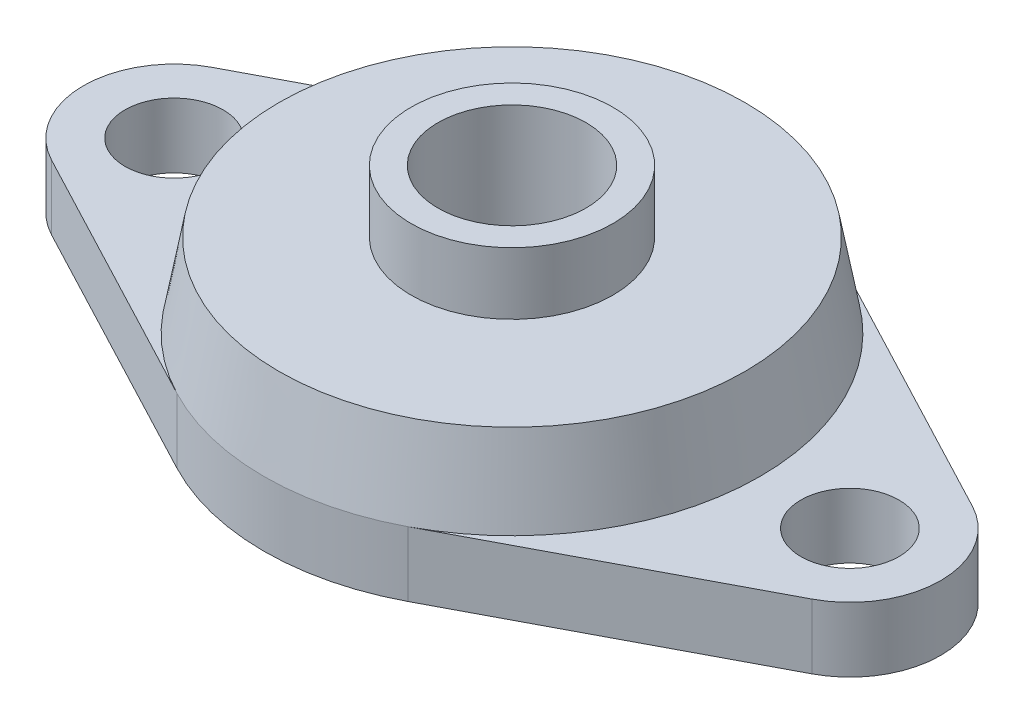
ISO-10303-21;
HEADER;
FILE_DESCRIPTION(('STEP AP214'),'2;1');
FILE_NAME('part.step','',(''),(''),'','','');
FILE_SCHEMA(('AUTOMOTIVE_DESIGN { 1 0 10303 214 1 1 1 1 }'));
ENDSEC;
DATA;
#1=APPLICATION_CONTEXT('core data for automotive mechanical design processes');
#2=APPLICATION_PROTOCOL_DEFINITION('international standard','automotive_design',2000,#1);
#3=PRODUCT_CONTEXT('',#1,'mechanical');
#4=PRODUCT('Part','Part','',(#3));
#5=PRODUCT_RELATED_PRODUCT_CATEGORY('part','',(#4));
#6=PRODUCT_DEFINITION_FORMATION('','',#4);
#7=PRODUCT_DEFINITION_CONTEXT('part definition',#1,'design');
#8=PRODUCT_DEFINITION('design','',#6,#7);
#9=PRODUCT_DEFINITION_SHAPE('','',#8);
#10=(LENGTH_UNIT() NAMED_UNIT(*) SI_UNIT(.MILLI.,.METRE.));
#11=(NAMED_UNIT(*) PLANE_ANGLE_UNIT() SI_UNIT($,.RADIAN.));
#12=(NAMED_UNIT(*) SI_UNIT($,.STERADIAN.) SOLID_ANGLE_UNIT());
#13=UNCERTAINTY_MEASURE_WITH_UNIT(LENGTH_MEASURE(1.E-05),#10,'distance_accuracy_value','');
#14=(GEOMETRIC_REPRESENTATION_CONTEXT(3) GLOBAL_UNCERTAINTY_ASSIGNED_CONTEXT((#13)) GLOBAL_UNIT_ASSIGNED_CONTEXT((#10,
#11,#12)) REPRESENTATION_CONTEXT('',''));
#15=CARTESIAN_POINT('',(0.,0.,0.));
#16=DIRECTION('',(0.,0.,1.));
#17=DIRECTION('',(1.,0.,0.));
#18=AXIS2_PLACEMENT_3D('',#15,#16,#17);
#19=CARTESIAN_POINT('',(-18.25,3.5,0.));
#20=DIRECTION('',(0.,1.,0.));
#21=DIRECTION('',(0.,0.,1.));
#22=AXIS2_PLACEMENT_3D('',#19,#20,#21);
#23=PLANE('',#22);
#24=CARTESIAN_POINT('',(18.25,3.5,0.));
#25=DIRECTION('',(0.,1.,0.));
#26=DIRECTION('',(0.,0.,1.));
#27=AXIS2_PLACEMENT_3D('',#24,#25,#26);
#28=CIRCLE('',#27,2.65);
#29=CARTESIAN_POINT('',(18.25,3.5,2.65));
#30=VERTEX_POINT('',#29);
#31=EDGE_CURVE('E227',#30,#30,#28,.T.);
#32=ORIENTED_EDGE('',*,*,#31,.F.);
#33=EDGE_LOOP('',(#32));
#34=FACE_BOUND('',#33,.T.);
#35=CARTESIAN_POINT('',(0.,3.50000000001014,0.));
#36=DIRECTION('',(0.,-1.,0.));
#37=DIRECTION('',(1.,0.,0.));
#38=AXIS2_PLACEMENT_3D('',#35,#36,#37);
#39=CIRCLE('',#38,13.4);
#40=CARTESIAN_POINT('',(6.24109589041096,3.50000000001013,-11.8578548686807));
#41=VERTEX_POINT('',#40);
#42=CARTESIAN_POINT('',(6.24109589041096,3.50000000001013,11.8578548686807));
#43=VERTEX_POINT('',#42);
#44=EDGE_CURVE('E125',#41,#43,#39,.T.);
#45=ORIENTED_EDGE('',*,*,#44,.T.);
#46=DIRECTION('',(0.884914542438861,0.,-0.465753424657534));
#47=VECTOR('',#46,1.);
#48=CARTESIAN_POINT('',(6.24109589041096,3.5,11.8578548686807));
#49=LINE('',#48,#47);
#50=CARTESIAN_POINT('',(20.5321917808219,3.5,4.33608125795042));
#51=VERTEX_POINT('',#50);
#52=EDGE_CURVE('E141',#43,#51,#49,.T.);
#53=ORIENTED_EDGE('',*,*,#52,.T.);
#54=CARTESIAN_POINT('',(18.25,3.5,0.));
#55=DIRECTION('',(0.,-1.,0.));
#56=DIRECTION('',(0.,0.,1.));
#57=AXIS2_PLACEMENT_3D('',#54,#55,#56);
#58=CIRCLE('',#57,4.9);
#59=CARTESIAN_POINT('',(20.5321917808219,3.5,-4.33608125795042));
#60=VERTEX_POINT('',#59);
#61=EDGE_CURVE('E106',#60,#51,#58,.T.);
#62=ORIENTED_EDGE('',*,*,#61,.F.);
#63=DIRECTION('',(0.884914542438861,0.,0.465753424657534));
#64=VECTOR('',#63,1.);
#65=CARTESIAN_POINT('',(6.24109589041096,3.5,-11.8578548686807));
#66=LINE('',#65,#64);
#67=EDGE_CURVE('E70',#41,#60,#66,.T.);
#68=ORIENTED_EDGE('',*,*,#67,.F.);
#69=EDGE_LOOP('',(#45,#53,#62,#68));
#70=FACE_BOUND('',#69,.T.);
#71=ADVANCED_FACE('F34',(#34,#70),#23,.T.);
#72=CARTESIAN_POINT('',(-18.25,3.5,0.));
#73=DIRECTION('',(0.,-1.,0.));
#74=DIRECTION('',(0.,0.,-1.));
#75=AXIS2_PLACEMENT_3D('',#72,#73,#74);
#76=CYLINDRICAL_SURFACE('',#75,4.9);
#77=CARTESIAN_POINT('',(-18.25,0.,0.));
#78=DIRECTION('',(0.,1.,0.));
#79=DIRECTION('',(0.,0.,1.));
#80=AXIS2_PLACEMENT_3D('',#77,#78,#79);
#81=CIRCLE('',#80,4.9);
#82=CARTESIAN_POINT('',(-20.5321917808219,0.,-4.33608125795042));
#83=VERTEX_POINT('',#82);
#84=CARTESIAN_POINT('',(-20.5321917808219,0.,4.33608125795042));
#85=VERTEX_POINT('',#84);
#86=EDGE_CURVE('E173',#83,#85,#81,.T.);
#87=ORIENTED_EDGE('',*,*,#86,.T.);
#88=DIRECTION('',(0.,-1.,0.));
#89=VECTOR('',#88,1.);
#90=CARTESIAN_POINT('',(-20.5321917808219,3.5,4.33608125795042));
#91=LINE('',#90,#89);
#92=CARTESIAN_POINT('',(-20.5321917808219,3.5,4.33608125795042));
#93=VERTEX_POINT('',#92);
#94=EDGE_CURVE('E157',#93,#85,#91,.T.);
#95=ORIENTED_EDGE('',*,*,#94,.F.);
#96=CARTESIAN_POINT('',(-18.25,3.5,0.));
#97=DIRECTION('',(0.,1.,0.));
#98=DIRECTION('',(0.,0.,1.));
#99=AXIS2_PLACEMENT_3D('',#96,#97,#98);
#100=CIRCLE('',#99,4.9);
#101=CARTESIAN_POINT('',(-20.5321917808219,3.5,-4.33608125795042));
#102=VERTEX_POINT('',#101);
#103=EDGE_CURVE('E85',#102,#93,#100,.T.);
#104=ORIENTED_EDGE('',*,*,#103,.F.);
#105=DIRECTION('',(0.,-1.,0.));
#106=VECTOR('',#105,1.);
#107=CARTESIAN_POINT('',(-20.5321917808219,3.5,-4.33608125795042));
#108=LINE('',#107,#106);
#109=EDGE_CURVE('E43',#102,#83,#108,.T.);
#110=ORIENTED_EDGE('',*,*,#109,.T.);
#111=EDGE_LOOP('',(#87,#95,#104,#110));
#112=FACE_BOUND('',#111,.T.);
#113=ADVANCED_FACE('F36',(#112),#76,.T.);
#114=CARTESIAN_POINT('',(0.,3.5,0.));
#115=DIRECTION('',(0.,-1.,0.));
#116=DIRECTION('',(0.,0.,-1.));
#117=AXIS2_PLACEMENT_3D('',#114,#115,#116);
#118=CYLINDRICAL_SURFACE('',#117,13.4);
#119=CARTESIAN_POINT('',(0.,0.,0.));
#120=DIRECTION('',(0.,1.,0.));
#121=DIRECTION('',(0.,0.,1.));
#122=AXIS2_PLACEMENT_3D('',#119,#120,#121);
#123=CIRCLE('',#122,13.4);
#124=CARTESIAN_POINT('',(6.24109589041096,0.,-11.8578548686807));
#125=VERTEX_POINT('',#124);
#126=CARTESIAN_POINT('',(-6.24109589041096,0.,-11.8578548686807));
#127=VERTEX_POINT('',#126);
#128=EDGE_CURVE('E63',#125,#127,#123,.T.);
#129=ORIENTED_EDGE('',*,*,#128,.T.);
#130=DIRECTION('',(0.,-1.,0.));
#131=VECTOR('',#130,1.);
#132=CARTESIAN_POINT('',(-6.24109589041096,3.5,-11.8578548686807));
#133=LINE('',#132,#131);
#134=CARTESIAN_POINT('',(-6.24109589041096,3.50000000001014,-11.8578548686807));
#135=VERTEX_POINT('',#134);
#136=EDGE_CURVE('E11',#135,#127,#133,.T.);
#137=ORIENTED_EDGE('',*,*,#136,.F.);
#138=CARTESIAN_POINT('',(0.,3.5,0.));
#139=DIRECTION('',(0.,1.,0.));
#140=DIRECTION('',(0.,0.,1.));
#141=AXIS2_PLACEMENT_3D('',#138,#139,#140);
#142=CIRCLE('',#141,13.4);
#143=EDGE_CURVE('E128',#41,#135,#142,.T.);
#144=ORIENTED_EDGE('',*,*,#143,.F.);
#145=DIRECTION('',(0.,-1.,0.));
#146=VECTOR('',#145,1.);
#147=CARTESIAN_POINT('',(6.24109589041096,3.5,-11.8578548686807));
#148=LINE('',#147,#146);
#149=EDGE_CURVE('E171',#41,#125,#148,.T.);
#150=ORIENTED_EDGE('',*,*,#149,.T.);
#151=EDGE_LOOP('',(#129,#137,#144,#150));
#152=FACE_BOUND('',#151,.T.);
#153=ADVANCED_FACE('F189',(#152),#118,.T.);
#154=CARTESIAN_POINT('',(-6.24109589041096,3.5,-11.8578548686807));
#155=DIRECTION('',(0.465753424657534,0.,0.884914542438861));
#156=DIRECTION('',(0.884914542438861,0.,-0.465753424657534));
#157=AXIS2_PLACEMENT_3D('',#154,#155,#156);
#158=PLANE('',#157);
#159=DIRECTION('',(-0.884914542438861,0.,0.465753424657534));
#160=VECTOR('',#159,1.);
#161=CARTESIAN_POINT('',(-6.24109589041096,0.,-11.8578548686807));
#162=LINE('',#161,#160);
#163=EDGE_CURVE('E175',#127,#83,#162,.T.);
#164=ORIENTED_EDGE('',*,*,#163,.T.);
#165=ORIENTED_EDGE('',*,*,#109,.F.);
#166=DIRECTION('',(-0.884914542438861,0.,0.465753424657534));
#167=VECTOR('',#166,1.);
#168=CARTESIAN_POINT('',(-6.24109589041096,3.5,-11.8578548686807));
#169=LINE('',#168,#167);
#170=EDGE_CURVE('E50',#135,#102,#169,.T.);
#171=ORIENTED_EDGE('',*,*,#170,.F.);
#172=ORIENTED_EDGE('',*,*,#136,.T.);
#173=EDGE_LOOP('',(#164,#165,#171,#172));
#174=FACE_BOUND('',#173,.T.);
#175=ADVANCED_FACE('F190',(#174),#158,.F.);
#176=CARTESIAN_POINT('',(-18.25,3.5,0.));
#177=DIRECTION('',(0.,1.,0.));
#178=DIRECTION('',(0.,0.,1.));
#179=AXIS2_PLACEMENT_3D('',#176,#177,#178);
#180=CIRCLE('',#179,2.65);
#181=CARTESIAN_POINT('',(-18.25,3.5,2.65));
#182=VERTEX_POINT('',#181);
#183=EDGE_CURVE('E363',#182,#182,#180,.T.);
#184=ORIENTED_EDGE('',*,*,#183,.F.);
#185=EDGE_LOOP('',(#184));
#186=FACE_BOUND('',#185,.T.);
#187=CARTESIAN_POINT('',(-6.24109589041096,3.5,11.8578548686807));
#188=VERTEX_POINT('',#187);
#189=EDGE_CURVE('E133',#188,#135,#39,.T.);
#190=ORIENTED_EDGE('',*,*,#189,.T.);
#191=ORIENTED_EDGE('',*,*,#170,.T.);
#192=ORIENTED_EDGE('',*,*,#103,.T.);
#193=DIRECTION('',(-0.884914542438861,0.,-0.465753424657534));
#194=VECTOR('',#193,1.);
#195=CARTESIAN_POINT('',(-6.24109589041096,3.5,11.8578548686807));
#196=LINE('',#195,#194);
#197=EDGE_CURVE('E136',#188,#93,#196,.T.);
#198=ORIENTED_EDGE('',*,*,#197,.F.);
#199=EDGE_LOOP('',(#190,#191,#192,#198));
#200=FACE_BOUND('',#199,.T.);
#201=ADVANCED_FACE('F187',(#186,#200),#23,.T.);
#202=CARTESIAN_POINT('',(-18.25,0.,0.));
#203=DIRECTION('',(0.,1.,0.));
#204=DIRECTION('',(0.,0.,1.));
#205=AXIS2_PLACEMENT_3D('',#202,#203,#204);
#206=PLANE('',#205);
#207=CARTESIAN_POINT('',(-18.25,0.,0.));
#208=DIRECTION('',(0.,-1.,0.));
#209=DIRECTION('',(0.,0.,-1.));
#210=AXIS2_PLACEMENT_3D('',#207,#208,#209);
#211=CIRCLE('',#210,2.65);
#212=CARTESIAN_POINT('',(-18.25,0.,-2.65));
#213=VERTEX_POINT('',#212);
#214=EDGE_CURVE('E218',#213,#213,#211,.T.);
#215=ORIENTED_EDGE('',*,*,#214,.F.);
#216=EDGE_LOOP('',(#215));
#217=FACE_BOUND('',#216,.T.);
#218=CARTESIAN_POINT('',(18.25,0.,0.));
#219=DIRECTION('',(0.,-1.,0.));
#220=DIRECTION('',(0.,0.,-1.));
#221=AXIS2_PLACEMENT_3D('',#218,#219,#220);
#222=CIRCLE('',#221,2.65);
#223=CARTESIAN_POINT('',(18.25,0.,-2.65));
#224=VERTEX_POINT('',#223);
#225=EDGE_CURVE('E222',#224,#224,#222,.T.);
#226=ORIENTED_EDGE('',*,*,#225,.F.);
#227=EDGE_LOOP('',(#226));
#228=FACE_BOUND('',#227,.T.);
#229=CARTESIAN_POINT('',(0.,0.,0.));
#230=DIRECTION('',(0.,-1.,0.));
#231=DIRECTION('',(0.,0.,-1.));
#232=AXIS2_PLACEMENT_3D('',#229,#230,#231);
#233=CIRCLE('',#232,4.);
#234=CARTESIAN_POINT('',(0.,0.,-4.));
#235=VERTEX_POINT('',#234);
#236=EDGE_CURVE('E225',#235,#235,#233,.T.);
#237=ORIENTED_EDGE('',*,*,#236,.F.);
#238=EDGE_LOOP('',(#237));
#239=FACE_BOUND('',#238,.T.);
#240=ORIENTED_EDGE('',*,*,#163,.F.);
#241=ORIENTED_EDGE('',*,*,#128,.F.);
#242=DIRECTION('',(0.884914542438861,0.,0.465753424657534));
#243=VECTOR('',#242,1.);
#244=CARTESIAN_POINT('',(6.24109589041096,0.,-11.8578548686807));
#245=LINE('',#244,#243);
#246=CARTESIAN_POINT('',(20.5321917808219,0.,-4.33608125795042));
#247=VERTEX_POINT('',#246);
#248=EDGE_CURVE('E165',#125,#247,#245,.T.);
#249=ORIENTED_EDGE('',*,*,#248,.T.);
#250=CARTESIAN_POINT('',(18.25,0.,0.));
#251=DIRECTION('',(0.,-1.,0.));
#252=DIRECTION('',(0.,0.,1.));
#253=AXIS2_PLACEMENT_3D('',#250,#251,#252);
#254=CIRCLE('',#253,4.9);
#255=CARTESIAN_POINT('',(20.5321917808219,0.,4.33608125795042));
#256=VERTEX_POINT('',#255);
#257=EDGE_CURVE('E163',#247,#256,#254,.T.);
#258=ORIENTED_EDGE('',*,*,#257,.T.);
#259=DIRECTION('',(0.884914542438861,0.,-0.465753424657534));
#260=VECTOR('',#259,1.);
#261=CARTESIAN_POINT('',(6.24109589041096,0.,11.8578548686807));
#262=LINE('',#261,#260);
#263=CARTESIAN_POINT('',(6.24109589041096,0.,11.8578548686807));
#264=VERTEX_POINT('',#263);
#265=EDGE_CURVE('E117',#264,#256,#262,.T.);
#266=ORIENTED_EDGE('',*,*,#265,.F.);
#267=CARTESIAN_POINT('',(0.,0.,0.));
#268=DIRECTION('',(0.,-1.,0.));
#269=DIRECTION('',(0.,0.,-1.));
#270=AXIS2_PLACEMENT_3D('',#267,#268,#269);
#271=CIRCLE('',#270,13.4);
#272=CARTESIAN_POINT('',(-6.24109589041096,0.,11.8578548686807));
#273=VERTEX_POINT('',#272);
#274=EDGE_CURVE('E151',#264,#273,#271,.T.);
#275=ORIENTED_EDGE('',*,*,#274,.T.);
#276=DIRECTION('',(-0.884914542438861,0.,-0.465753424657534));
#277=VECTOR('',#276,1.);
#278=CARTESIAN_POINT('',(-6.24109589041096,0.,11.8578548686807));
#279=LINE('',#278,#277);
#280=EDGE_CURVE('E97',#273,#85,#279,.T.);
#281=ORIENTED_EDGE('',*,*,#280,.T.);
#282=ORIENTED_EDGE('',*,*,#86,.F.);
#283=EDGE_LOOP('',(#240,#241,#249,#258,#266,#275,#281,#282));
#284=FACE_BOUND('',#283,.T.);
#285=ADVANCED_FACE('F185',(#217,#228,#239,#284),#206,.F.);
#286=CARTESIAN_POINT('',(18.25,3.5,0.));
#287=DIRECTION('',(0.,-1.,0.));
#288=DIRECTION('',(0.,0.,-1.));
#289=AXIS2_PLACEMENT_3D('',#286,#287,#288);
#290=CYLINDRICAL_SURFACE('',#289,4.9);
#291=ORIENTED_EDGE('',*,*,#257,.F.);
#292=DIRECTION('',(0.,-1.,0.));
#293=VECTOR('',#292,1.);
#294=CARTESIAN_POINT('',(20.5321917808219,3.5,-4.33608125795042));
#295=LINE('',#294,#293);
#296=EDGE_CURVE('E167',#60,#247,#295,.T.);
#297=ORIENTED_EDGE('',*,*,#296,.F.);
#298=ORIENTED_EDGE('',*,*,#61,.T.);
#299=DIRECTION('',(0.,-1.,0.));
#300=VECTOR('',#299,1.);
#301=CARTESIAN_POINT('',(20.5321917808219,3.5,4.33608125795042));
#302=LINE('',#301,#300);
#303=EDGE_CURVE('E148',#51,#256,#302,.T.);
#304=ORIENTED_EDGE('',*,*,#303,.T.);
#305=EDGE_LOOP('',(#291,#297,#298,#304));
#306=FACE_BOUND('',#305,.T.);
#307=ADVANCED_FACE('F207',(#306),#290,.T.);
#308=CARTESIAN_POINT('',(6.24109589041096,3.5,-11.8578548686807));
#309=DIRECTION('',(-0.465753424657534,0.,0.884914542438861));
#310=DIRECTION('',(-0.884914542438861,0.,-0.465753424657534));
#311=AXIS2_PLACEMENT_3D('',#308,#309,#310);
#312=PLANE('',#311);
#313=ORIENTED_EDGE('',*,*,#248,.F.);
#314=ORIENTED_EDGE('',*,*,#149,.F.);
#315=ORIENTED_EDGE('',*,*,#67,.T.);
#316=ORIENTED_EDGE('',*,*,#296,.T.);
#317=EDGE_LOOP('',(#313,#314,#315,#316));
#318=FACE_BOUND('',#317,.T.);
#319=ADVANCED_FACE('F214',(#318),#312,.F.);
#320=CARTESIAN_POINT('',(0.,3.5,0.));
#321=DIRECTION('',(0.,-1.,0.));
#322=DIRECTION('',(0.,0.,1.));
#323=AXIS2_PLACEMENT_3D('',#320,#321,#322);
#324=CYLINDRICAL_SURFACE('',#323,13.4);
#325=ORIENTED_EDGE('',*,*,#274,.F.);
#326=DIRECTION('',(0.,-1.,0.));
#327=VECTOR('',#326,1.);
#328=CARTESIAN_POINT('',(6.24109589041096,3.5,11.8578548686807));
#329=LINE('',#328,#327);
#330=EDGE_CURVE('E146',#43,#264,#329,.T.);
#331=ORIENTED_EDGE('',*,*,#330,.F.);
#332=CARTESIAN_POINT('',(0.,3.5,0.));
#333=DIRECTION('',(0.,-1.,0.));
#334=DIRECTION('',(0.,0.,-1.));
#335=AXIS2_PLACEMENT_3D('',#332,#333,#334);
#336=CIRCLE('',#335,13.4);
#337=EDGE_CURVE('E131',#43,#188,#336,.T.);
#338=ORIENTED_EDGE('',*,*,#337,.T.);
#339=DIRECTION('',(0.,-1.,0.));
#340=VECTOR('',#339,1.);
#341=CARTESIAN_POINT('',(-6.24109589041096,3.5,11.8578548686807));
#342=LINE('',#341,#340);
#343=EDGE_CURVE('E161',#188,#273,#342,.T.);
#344=ORIENTED_EDGE('',*,*,#343,.T.);
#345=EDGE_LOOP('',(#325,#331,#338,#344));
#346=FACE_BOUND('',#345,.T.);
#347=ADVANCED_FACE('F150',(#346),#324,.T.);
#348=CARTESIAN_POINT('',(-6.24109589041096,3.5,11.8578548686807));
#349=DIRECTION('',(0.465753424657534,0.,-0.884914542438861));
#350=DIRECTION('',(0.884914542438861,0.,0.465753424657534));
#351=AXIS2_PLACEMENT_3D('',#348,#349,#350);
#352=PLANE('',#351);
#353=ORIENTED_EDGE('',*,*,#280,.F.);
#354=ORIENTED_EDGE('',*,*,#343,.F.);
#355=ORIENTED_EDGE('',*,*,#197,.T.);
#356=ORIENTED_EDGE('',*,*,#94,.T.);
#357=EDGE_LOOP('',(#353,#354,#355,#356));
#358=FACE_BOUND('',#357,.T.);
#359=ADVANCED_FACE('F186',(#358),#352,.F.);
#360=CARTESIAN_POINT('',(6.24109589041096,3.5,11.8578548686807));
#361=DIRECTION('',(-0.465753424657534,0.,-0.884914542438861));
#362=DIRECTION('',(-0.884914542438861,0.,0.465753424657534));
#363=AXIS2_PLACEMENT_3D('',#360,#361,#362);
#364=PLANE('',#363);
#365=ORIENTED_EDGE('',*,*,#265,.T.);
#366=ORIENTED_EDGE('',*,*,#303,.F.);
#367=ORIENTED_EDGE('',*,*,#52,.F.);
#368=ORIENTED_EDGE('',*,*,#330,.T.);
#369=EDGE_LOOP('',(#365,#366,#367,#368));
#370=FACE_BOUND('',#369,.T.);
#371=ADVANCED_FACE('F145',(#370),#364,.F.);
#372=CARTESIAN_POINT('',(0.,11.3499999999931,0.));
#373=DIRECTION('',(0.,1.,0.));
#374=DIRECTION('',(-1.,0.,0.));
#375=AXIS2_PLACEMENT_3D('',#372,#373,#374);
#376=PLANE('',#375);
#377=CARTESIAN_POINT('',(0.,11.3499999999931,0.));
#378=DIRECTION('',(0.,-1.,0.));
#379=DIRECTION('',(0.,0.,-1.));
#380=AXIS2_PLACEMENT_3D('',#377,#378,#379);
#381=CIRCLE('',#380,4.);
#382=CARTESIAN_POINT('',(0.,11.3499999999931,-4.));
#383=VERTEX_POINT('',#382);
#384=EDGE_CURVE('E142',#383,#383,#381,.T.);
#385=ORIENTED_EDGE('',*,*,#384,.T.);
#386=EDGE_LOOP('',(#385));
#387=FACE_BOUND('',#386,.T.);
#388=CARTESIAN_POINT('',(0.,11.3499999999931,0.));
#389=DIRECTION('',(0.,-1.,0.));
#390=DIRECTION('',(1.,0.,0.));
#391=AXIS2_PLACEMENT_3D('',#388,#389,#390);
#392=CIRCLE('',#391,5.44999984985275);
#393=CARTESIAN_POINT('',(5.44999984985276,11.3499999999931,0.));
#394=VERTEX_POINT('',#393);
#395=EDGE_CURVE('E239',#394,#394,#392,.T.);
#396=ORIENTED_EDGE('',*,*,#395,.F.);
#397=EDGE_LOOP('',(#396));
#398=FACE_BOUND('',#397,.T.);
#399=ADVANCED_FACE('F246',(#387,#398),#376,.T.);
#400=CARTESIAN_POINT('',(0.,0.,0.));
#401=DIRECTION('',(0.,-1.,0.));
#402=DIRECTION('',(1.,0.,0.));
#403=AXIS2_PLACEMENT_3D('',#400,#401,#402);
#404=CYLINDRICAL_SURFACE('',#403,5.44999984985275);
#405=ORIENTED_EDGE('',*,*,#395,.T.);
#406=EDGE_LOOP('',(#405));
#407=FACE_BOUND('',#406,.T.);
#408=CARTESIAN_POINT('',(0.,7.99999976023933,0.));
#409=DIRECTION('',(0.,-1.,0.));
#410=DIRECTION('',(1.,0.,0.));
#411=AXIS2_PLACEMENT_3D('',#408,#409,#410);
#412=CIRCLE('',#411,5.44999984985275);
#413=CARTESIAN_POINT('',(5.44999984985276,7.99999976023932,0.));
#414=VERTEX_POINT('',#413);
#415=EDGE_CURVE('E236',#414,#414,#412,.T.);
#416=ORIENTED_EDGE('',*,*,#415,.F.);
#417=EDGE_LOOP('',(#416));
#418=FACE_BOUND('',#417,.T.);
#419=ADVANCED_FACE('F243',(#407,#418),#404,.T.);
#420=CARTESIAN_POINT('',(5.44999984985276,7.99999976023933,0.));
#421=DIRECTION('',(0.,1.,0.));
#422=DIRECTION('',(-1.,0.,0.));
#423=AXIS2_PLACEMENT_3D('',#420,#421,#422);
#424=PLANE('',#423);
#425=ORIENTED_EDGE('',*,*,#415,.T.);
#426=EDGE_LOOP('',(#425));
#427=FACE_BOUND('',#426,.T.);
#428=CARTESIAN_POINT('',(0.,7.99999976023933,0.));
#429=DIRECTION('',(0.,-1.,0.));
#430=DIRECTION('',(1.,0.,0.));
#431=AXIS2_PLACEMENT_3D('',#428,#429,#430);
#432=CIRCLE('',#431,12.5825393847694);
#433=CARTESIAN_POINT('',(12.5825393847694,7.99999976023933,0.));
#434=VERTEX_POINT('',#433);
#435=EDGE_CURVE('E188',#434,#434,#432,.T.);
#436=ORIENTED_EDGE('',*,*,#435,.F.);
#437=EDGE_LOOP('',(#436));
#438=FACE_BOUND('',#437,.T.);
#439=ADVANCED_FACE('F254',(#427,#438),#424,.T.);
#440=CARTESIAN_POINT('',(0.,3.50000000001014,0.));
#441=DIRECTION('',(0.,-1.,0.));
#442=DIRECTION('',(1.,0.,0.));
#443=AXIS2_PLACEMENT_3D('',#440,#441,#442);
#444=CONICAL_SURFACE('',#443,13.4,0.179698366019388);
#445=ORIENTED_EDGE('',*,*,#435,.T.);
#446=EDGE_LOOP('',(#445));
#447=FACE_BOUND('',#446,.T.);
#448=ORIENTED_EDGE('',*,*,#337,.F.);
#449=ORIENTED_EDGE('',*,*,#44,.F.);
#450=ORIENTED_EDGE('',*,*,#143,.T.);
#451=ORIENTED_EDGE('',*,*,#189,.F.);
#452=EDGE_LOOP('',(#448,#449,#450,#451));
#453=FACE_BOUND('',#452,.T.);
#454=ADVANCED_FACE('F132',(#447,#453),#444,.T.);
#455=CARTESIAN_POINT('',(0.,11.3499999999931,0.));
#456=DIRECTION('',(0.,-1.,0.));
#457=DIRECTION('',(0.,0.,-1.));
#458=AXIS2_PLACEMENT_3D('',#455,#456,#457);
#459=CYLINDRICAL_SURFACE('',#458,4.);
#460=ORIENTED_EDGE('',*,*,#384,.F.);
#461=EDGE_LOOP('',(#460));
#462=FACE_BOUND('',#461,.T.);
#463=ORIENTED_EDGE('',*,*,#236,.T.);
#464=EDGE_LOOP('',(#463));
#465=FACE_BOUND('',#464,.T.);
#466=ADVANCED_FACE('F304',(#462,#465),#459,.F.);
#467=CARTESIAN_POINT('',(18.25,0.,0.));
#468=DIRECTION('',(0.,-1.,0.));
#469=DIRECTION('',(0.,0.,-1.));
#470=AXIS2_PLACEMENT_3D('',#467,#468,#469);
#471=CYLINDRICAL_SURFACE('',#470,2.65);
#472=ORIENTED_EDGE('',*,*,#31,.T.);
#473=EDGE_LOOP('',(#472));
#474=FACE_BOUND('',#473,.T.);
#475=ORIENTED_EDGE('',*,*,#225,.T.);
#476=EDGE_LOOP('',(#475));
#477=FACE_BOUND('',#476,.T.);
#478=ADVANCED_FACE('F318',(#474,#477),#471,.F.);
#479=CARTESIAN_POINT('',(-18.25,0.,0.));
#480=DIRECTION('',(0.,-1.,0.));
#481=DIRECTION('',(0.,0.,-1.));
#482=AXIS2_PLACEMENT_3D('',#479,#480,#481);
#483=CYLINDRICAL_SURFACE('',#482,2.65);
#484=ORIENTED_EDGE('',*,*,#183,.T.);
#485=EDGE_LOOP('',(#484));
#486=FACE_BOUND('',#485,.T.);
#487=ORIENTED_EDGE('',*,*,#214,.T.);
#488=EDGE_LOOP('',(#487));
#489=FACE_BOUND('',#488,.T.);
#490=ADVANCED_FACE('F346',(#486,#489),#483,.F.);
#491=CLOSED_SHELL('',(#71,#113,#153,#175,#201,#285,#307,#319,#347,#359,#371,#399,#419,#439,#454,
#466,#478,#490));
#492=MANIFOLD_SOLID_BREP('B2',#491);
#493=ADVANCED_BREP_SHAPE_REPRESENTATION('',(#18,#492),#14);
#494=SHAPE_DEFINITION_REPRESENTATION(#9,#493);
ENDSEC;
END-ISO-10303-21;
